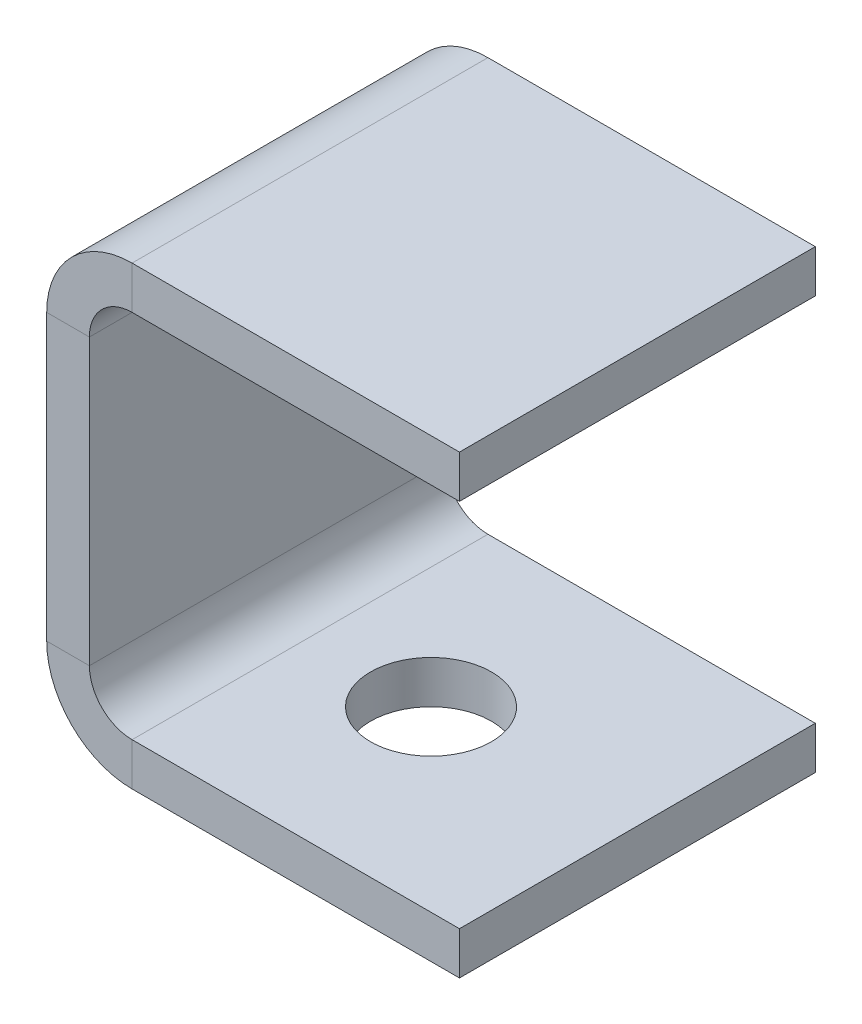
ISO-10303-21;
HEADER;
FILE_DESCRIPTION(('STEP AP214'),'2;1');
FILE_NAME('part.step','',(''),(''),'','','');
FILE_SCHEMA(('AUTOMOTIVE_DESIGN { 1 0 10303 214 1 1 1 1 }'));
ENDSEC;
DATA;
#1=APPLICATION_CONTEXT('core data for automotive mechanical design processes');
#2=APPLICATION_PROTOCOL_DEFINITION('international standard','automotive_design',2000,#1);
#3=PRODUCT_CONTEXT('',#1,'mechanical');
#4=PRODUCT('Part','Part','',(#3));
#5=PRODUCT_RELATED_PRODUCT_CATEGORY('part','',(#4));
#6=PRODUCT_DEFINITION_FORMATION('','',#4);
#7=PRODUCT_DEFINITION_CONTEXT('part definition',#1,'design');
#8=PRODUCT_DEFINITION('design','',#6,#7);
#9=PRODUCT_DEFINITION_SHAPE('','',#8);
#10=(LENGTH_UNIT() NAMED_UNIT(*) SI_UNIT(.MILLI.,.METRE.));
#11=(NAMED_UNIT(*) PLANE_ANGLE_UNIT() SI_UNIT($,.RADIAN.));
#12=(NAMED_UNIT(*) SI_UNIT($,.STERADIAN.) SOLID_ANGLE_UNIT());
#13=UNCERTAINTY_MEASURE_WITH_UNIT(LENGTH_MEASURE(1.E-05),#10,'distance_accuracy_value','');
#14=(GEOMETRIC_REPRESENTATION_CONTEXT(3) GLOBAL_UNCERTAINTY_ASSIGNED_CONTEXT((#13)) GLOBAL_UNIT_ASSIGNED_CONTEXT((#10,
#11,#12)) REPRESENTATION_CONTEXT('',''));
#15=CARTESIAN_POINT('',(0.,0.,0.));
#16=DIRECTION('',(0.,0.,1.));
#17=DIRECTION('',(1.,0.,0.));
#18=AXIS2_PLACEMENT_3D('',#15,#16,#17);
#19=CARTESIAN_POINT('',(6.00000000000007,-26.0000000000001,50.));
#20=DIRECTION('',(0.,0.,1.));
#21=DIRECTION('',(1.,0.,0.));
#22=AXIS2_PLACEMENT_3D('',#19,#20,#21);
#23=PLANE('',#22);
#24=DIRECTION('',(0.,-1.,0.));
#25=VECTOR('',#24,1.);
#26=CARTESIAN_POINT('',(6.00000000000007,-26.0000000000001,50.));
#27=LINE('',#26,#25);
#28=CARTESIAN_POINT('',(6.00000000000007,-26.0000000000001,50.));
#29=VERTEX_POINT('',#28);
#30=CARTESIAN_POINT('',(6.00000000000006,-32.0000000000002,50.));
#31=VERTEX_POINT('',#30);
#32=EDGE_CURVE('E13',#29,#31,#27,.T.);
#33=ORIENTED_EDGE('',*,*,#32,.F.);
#34=CARTESIAN_POINT('',(6.00000000000007,-20.,50.));
#35=DIRECTION('',(0.,0.,1.));
#36=DIRECTION('',(1.,0.,0.));
#37=AXIS2_PLACEMENT_3D('',#34,#35,#36);
#38=CIRCLE('',#37,6.);
#39=CARTESIAN_POINT('',(0.,-20.,50.));
#40=VERTEX_POINT('',#39);
#41=EDGE_CURVE('E160',#29,#40,#38,.F.);
#42=ORIENTED_EDGE('',*,*,#41,.T.);
#43=DIRECTION('',(1.,0.,0.));
#44=VECTOR('',#43,1.);
#45=CARTESIAN_POINT('',(-6.00000000000006,-20.,50.));
#46=LINE('',#45,#44);
#47=CARTESIAN_POINT('',(-6.00000000000006,-20.,50.));
#48=VERTEX_POINT('',#47);
#49=EDGE_CURVE('E58',#48,#40,#46,.T.);
#50=ORIENTED_EDGE('',*,*,#49,.F.);
#51=CARTESIAN_POINT('',(6.00000000000007,-20.,50.));
#52=DIRECTION('',(0.,0.,1.));
#53=DIRECTION('',(1.,0.,0.));
#54=AXIS2_PLACEMENT_3D('',#51,#52,#53);
#55=CIRCLE('',#54,12.);
#56=EDGE_CURVE('E255',#31,#48,#55,.F.);
#57=ORIENTED_EDGE('',*,*,#56,.F.);
#58=EDGE_LOOP('',(#33,#42,#50,#57));
#59=FACE_BOUND('',#58,.T.);
#60=ADVANCED_FACE('F50',(#59),#23,.T.);
#61=CARTESIAN_POINT('',(-6.00000000000006,-20.,50.));
#62=DIRECTION('',(0.,0.,1.));
#63=DIRECTION('',(1.,0.,0.));
#64=AXIS2_PLACEMENT_3D('',#61,#62,#63);
#65=PLANE('',#64);
#66=DIRECTION('',(-1.,0.,0.));
#67=VECTOR('',#66,1.);
#68=CARTESIAN_POINT('',(0.,-26.0000000000001,50.));
#69=LINE('',#68,#67);
#70=CARTESIAN_POINT('',(52.0000000000003,-26.0000000000001,50.));
#71=VERTEX_POINT('',#70);
#72=EDGE_CURVE('E165',#71,#29,#69,.T.);
#73=ORIENTED_EDGE('',*,*,#72,.T.);
#74=ORIENTED_EDGE('',*,*,#32,.T.);
#75=DIRECTION('',(1.,0.,0.));
#76=VECTOR('',#75,1.);
#77=CARTESIAN_POINT('',(0.,-32.0000000000002,50.));
#78=LINE('',#77,#76);
#79=CARTESIAN_POINT('',(52.0000000000003,-32.0000000000002,50.));
#80=VERTEX_POINT('',#79);
#81=EDGE_CURVE('E268',#80,#31,#78,.F.);
#82=ORIENTED_EDGE('',*,*,#81,.F.);
#83=DIRECTION('',(0.,-1.,0.));
#84=VECTOR('',#83,1.);
#85=CARTESIAN_POINT('',(52.0000000000003,-26.0000000000001,50.));
#86=LINE('',#85,#84);
#87=EDGE_CURVE('E270',#71,#80,#86,.T.);
#88=ORIENTED_EDGE('',*,*,#87,.F.);
#89=EDGE_LOOP('',(#73,#74,#82,#88));
#90=FACE_BOUND('',#89,.T.);
#91=ADVANCED_FACE('F281',(#90),#65,.T.);
#92=CARTESIAN_POINT('',(0.,-20.,0.));
#93=DIRECTION('',(0.,0.,-1.));
#94=DIRECTION('',(-1.,0.,0.));
#95=AXIS2_PLACEMENT_3D('',#92,#93,#94);
#96=PLANE('',#95);
#97=DIRECTION('',(-1.,0.,0.));
#98=VECTOR('',#97,1.);
#99=CARTESIAN_POINT('',(0.,-20.,0.));
#100=LINE('',#99,#98);
#101=CARTESIAN_POINT('',(0.,-20.,0.));
#102=VERTEX_POINT('',#101);
#103=CARTESIAN_POINT('',(-6.00000000000006,-20.,0.));
#104=VERTEX_POINT('',#103);
#105=EDGE_CURVE('E158',#102,#104,#100,.T.);
#106=ORIENTED_EDGE('',*,*,#105,.F.);
#107=CARTESIAN_POINT('',(6.00000000000007,-20.,0.));
#108=DIRECTION('',(0.,0.,1.));
#109=DIRECTION('',(1.,0.,0.));
#110=AXIS2_PLACEMENT_3D('',#107,#108,#109);
#111=CIRCLE('',#110,6.);
#112=CARTESIAN_POINT('',(6.00000000000007,-26.0000000000001,0.));
#113=VERTEX_POINT('',#112);
#114=EDGE_CURVE('E172',#113,#102,#111,.F.);
#115=ORIENTED_EDGE('',*,*,#114,.F.);
#116=DIRECTION('',(0.,1.,0.));
#117=VECTOR('',#116,1.);
#118=CARTESIAN_POINT('',(6.00000000000006,-32.0000000000002,0.));
#119=LINE('',#118,#117);
#120=CARTESIAN_POINT('',(6.00000000000006,-32.0000000000002,0.));
#121=VERTEX_POINT('',#120);
#122=EDGE_CURVE('E246',#121,#113,#119,.T.);
#123=ORIENTED_EDGE('',*,*,#122,.F.);
#124=CARTESIAN_POINT('',(6.00000000000007,-20.,0.));
#125=DIRECTION('',(0.,0.,1.));
#126=DIRECTION('',(1.,0.,0.));
#127=AXIS2_PLACEMENT_3D('',#124,#125,#126);
#128=CIRCLE('',#127,12.);
#129=EDGE_CURVE('E200',#121,#104,#128,.F.);
#130=ORIENTED_EDGE('',*,*,#129,.T.);
#131=EDGE_LOOP('',(#106,#115,#123,#130));
#132=FACE_BOUND('',#131,.T.);
#133=ADVANCED_FACE('F260',(#132),#96,.T.);
#134=CARTESIAN_POINT('',(6.00000000000006,-32.0000000000002,0.));
#135=DIRECTION('',(0.,0.,-1.));
#136=DIRECTION('',(-1.,0.,0.));
#137=AXIS2_PLACEMENT_3D('',#134,#135,#136);
#138=PLANE('',#137);
#139=DIRECTION('',(0.,1.,0.));
#140=VECTOR('',#139,1.);
#141=CARTESIAN_POINT('',(0.,26.0000000000002,0.));
#142=LINE('',#141,#140);
#143=CARTESIAN_POINT('',(0.,20.0000000000001,0.));
#144=VERTEX_POINT('',#143);
#145=EDGE_CURVE('E213',#102,#144,#142,.T.);
#146=ORIENTED_EDGE('',*,*,#145,.F.);
#147=ORIENTED_EDGE('',*,*,#105,.T.);
#148=DIRECTION('',(0.,1.,0.));
#149=VECTOR('',#148,1.);
#150=CARTESIAN_POINT('',(-6.00000000000012,26.0000000000002,0.));
#151=LINE('',#150,#149);
#152=CARTESIAN_POINT('',(-6.00000000000012,20.0000000000001,0.));
#153=VERTEX_POINT('',#152);
#154=EDGE_CURVE('E198',#104,#153,#151,.T.);
#155=ORIENTED_EDGE('',*,*,#154,.T.);
#156=DIRECTION('',(1.,0.,0.));
#157=VECTOR('',#156,1.);
#158=CARTESIAN_POINT('',(-6.00000000000012,20.0000000000001,0.));
#159=LINE('',#158,#157);
#160=EDGE_CURVE('E107',#153,#144,#159,.T.);
#161=ORIENTED_EDGE('',*,*,#160,.T.);
#162=EDGE_LOOP('',(#146,#147,#155,#161));
#163=FACE_BOUND('',#162,.T.);
#164=ADVANCED_FACE('F248',(#163),#138,.T.);
#165=CARTESIAN_POINT('',(0.,20.0000000000001,50.));
#166=DIRECTION('',(0.,0.,1.));
#167=DIRECTION('',(1.,0.,0.));
#168=AXIS2_PLACEMENT_3D('',#165,#166,#167);
#169=PLANE('',#168);
#170=DIRECTION('',(-1.,0.,0.));
#171=VECTOR('',#170,1.);
#172=CARTESIAN_POINT('',(0.,20.0000000000001,50.));
#173=LINE('',#172,#171);
#174=CARTESIAN_POINT('',(0.,20.0000000000001,50.));
#175=VERTEX_POINT('',#174);
#176=CARTESIAN_POINT('',(-6.00000000000012,20.0000000000001,50.));
#177=VERTEX_POINT('',#176);
#178=EDGE_CURVE('E244',#175,#177,#173,.T.);
#179=ORIENTED_EDGE('',*,*,#178,.F.);
#180=CARTESIAN_POINT('',(6.00000000000004,20.0000000000001,50.));
#181=DIRECTION('',(0.,0.,1.));
#182=DIRECTION('',(1.,0.,0.));
#183=AXIS2_PLACEMENT_3D('',#180,#181,#182);
#184=CIRCLE('',#183,6.);
#185=CARTESIAN_POINT('',(6.00000000000004,26.0000000000002,50.));
#186=VERTEX_POINT('',#185);
#187=EDGE_CURVE('E180',#175,#186,#184,.F.);
#188=ORIENTED_EDGE('',*,*,#187,.T.);
#189=DIRECTION('',(0.,-1.,0.));
#190=VECTOR('',#189,1.);
#191=CARTESIAN_POINT('',(6.00000000000004,32.0000000000001,50.));
#192=LINE('',#191,#190);
#193=CARTESIAN_POINT('',(6.00000000000004,32.0000000000001,50.));
#194=VERTEX_POINT('',#193);
#195=EDGE_CURVE('E66',#194,#186,#192,.T.);
#196=ORIENTED_EDGE('',*,*,#195,.F.);
#197=CARTESIAN_POINT('',(6.00000000000004,20.0000000000001,50.));
#198=DIRECTION('',(0.,0.,1.));
#199=DIRECTION('',(1.,0.,0.));
#200=AXIS2_PLACEMENT_3D('',#197,#198,#199);
#201=CIRCLE('',#200,12.);
#202=EDGE_CURVE('E272',#177,#194,#201,.F.);
#203=ORIENTED_EDGE('',*,*,#202,.F.);
#204=EDGE_LOOP('',(#179,#188,#196,#203));
#205=FACE_BOUND('',#204,.T.);
#206=ADVANCED_FACE('F309',(#205),#169,.T.);
#207=CARTESIAN_POINT('',(6.00000000000004,32.0000000000001,50.));
#208=DIRECTION('',(0.,0.,1.));
#209=DIRECTION('',(1.,0.,0.));
#210=AXIS2_PLACEMENT_3D('',#207,#208,#209);
#211=PLANE('',#210);
#212=DIRECTION('',(0.,1.,0.));
#213=VECTOR('',#212,1.);
#214=CARTESIAN_POINT('',(0.,26.0000000000002,50.));
#215=LINE('',#214,#213);
#216=EDGE_CURVE('E150',#40,#175,#215,.T.);
#217=ORIENTED_EDGE('',*,*,#216,.T.);
#218=ORIENTED_EDGE('',*,*,#178,.T.);
#219=DIRECTION('',(0.,1.,0.));
#220=VECTOR('',#219,1.);
#221=CARTESIAN_POINT('',(-6.00000000000012,26.0000000000002,50.));
#222=LINE('',#221,#220);
#223=EDGE_CURVE('E153',#48,#177,#222,.T.);
#224=ORIENTED_EDGE('',*,*,#223,.F.);
#225=ORIENTED_EDGE('',*,*,#49,.T.);
#226=EDGE_LOOP('',(#217,#218,#224,#225));
#227=FACE_BOUND('',#226,.T.);
#228=ADVANCED_FACE('F148',(#227),#211,.T.);
#229=CARTESIAN_POINT('',(6.00000000000004,26.0000000000002,0.));
#230=DIRECTION('',(0.,0.,-1.));
#231=DIRECTION('',(-1.,0.,0.));
#232=AXIS2_PLACEMENT_3D('',#229,#230,#231);
#233=PLANE('',#232);
#234=DIRECTION('',(0.,1.,0.));
#235=VECTOR('',#234,1.);
#236=CARTESIAN_POINT('',(6.00000000000004,26.0000000000002,0.));
#237=LINE('',#236,#235);
#238=CARTESIAN_POINT('',(6.00000000000004,26.0000000000002,0.));
#239=VERTEX_POINT('',#238);
#240=CARTESIAN_POINT('',(6.00000000000004,32.0000000000001,0.));
#241=VERTEX_POINT('',#240);
#242=EDGE_CURVE('E114',#239,#241,#237,.T.);
#243=ORIENTED_EDGE('',*,*,#242,.F.);
#244=CARTESIAN_POINT('',(6.00000000000004,20.0000000000001,0.));
#245=DIRECTION('',(0.,0.,1.));
#246=DIRECTION('',(1.,0.,0.));
#247=AXIS2_PLACEMENT_3D('',#244,#245,#246);
#248=CIRCLE('',#247,6.);
#249=EDGE_CURVE('E215',#144,#239,#248,.F.);
#250=ORIENTED_EDGE('',*,*,#249,.F.);
#251=ORIENTED_EDGE('',*,*,#160,.F.);
#252=CARTESIAN_POINT('',(6.00000000000004,20.0000000000001,0.));
#253=DIRECTION('',(0.,0.,1.));
#254=DIRECTION('',(1.,0.,0.));
#255=AXIS2_PLACEMENT_3D('',#252,#253,#254);
#256=CIRCLE('',#255,12.);
#257=EDGE_CURVE('E196',#153,#241,#256,.F.);
#258=ORIENTED_EDGE('',*,*,#257,.T.);
#259=EDGE_LOOP('',(#243,#250,#251,#258));
#260=FACE_BOUND('',#259,.T.);
#261=ADVANCED_FACE('F315',(#260),#233,.T.);
#262=CARTESIAN_POINT('',(-6.00000000000012,20.0000000000001,0.));
#263=DIRECTION('',(0.,0.,-1.));
#264=DIRECTION('',(-1.,0.,0.));
#265=AXIS2_PLACEMENT_3D('',#262,#263,#264);
#266=PLANE('',#265);
#267=DIRECTION('',(1.,0.,0.));
#268=VECTOR('',#267,1.);
#269=CARTESIAN_POINT('',(0.,26.0000000000002,0.));
#270=LINE('',#269,#268);
#271=CARTESIAN_POINT('',(52.0000000000003,26.0000000000001,0.));
#272=VERTEX_POINT('',#271);
#273=EDGE_CURVE('E186',#239,#272,#270,.T.);
#274=ORIENTED_EDGE('',*,*,#273,.F.);
#275=ORIENTED_EDGE('',*,*,#242,.T.);
#276=DIRECTION('',(1.,0.,0.));
#277=VECTOR('',#276,1.);
#278=CARTESIAN_POINT('',(0.,32.0000000000001,0.));
#279=LINE('',#278,#277);
#280=CARTESIAN_POINT('',(52.0000000000003,32.0000000000001,0.));
#281=VERTEX_POINT('',#280);
#282=EDGE_CURVE('E193',#241,#281,#279,.T.);
#283=ORIENTED_EDGE('',*,*,#282,.T.);
#284=DIRECTION('',(0.,-1.,0.));
#285=VECTOR('',#284,1.);
#286=CARTESIAN_POINT('',(52.0000000000003,32.0000000000001,0.));
#287=LINE('',#286,#285);
#288=EDGE_CURVE('E189',#281,#272,#287,.T.);
#289=ORIENTED_EDGE('',*,*,#288,.T.);
#290=EDGE_LOOP('',(#274,#275,#283,#289));
#291=FACE_BOUND('',#290,.T.);
#292=ADVANCED_FACE('F318',(#291),#266,.T.);
#293=CARTESIAN_POINT('',(0.,26.0000000000002,50.));
#294=DIRECTION('',(0.,1.,0.));
#295=DIRECTION('',(0.,0.,1.));
#296=AXIS2_PLACEMENT_3D('',#293,#294,#295);
#297=PLANE('',#296);
#298=ORIENTED_EDGE('',*,*,#273,.T.);
#299=DIRECTION('',(0.,0.,-1.));
#300=VECTOR('',#299,1.);
#301=CARTESIAN_POINT('',(52.0000000000003,26.0000000000001,50.));
#302=LINE('',#301,#300);
#303=CARTESIAN_POINT('',(52.0000000000003,26.0000000000001,50.));
#304=VERTEX_POINT('',#303);
#305=EDGE_CURVE('E239',#304,#272,#302,.T.);
#306=ORIENTED_EDGE('',*,*,#305,.F.);
#307=DIRECTION('',(1.,0.,0.));
#308=VECTOR('',#307,1.);
#309=CARTESIAN_POINT('',(0.,26.0000000000002,50.));
#310=LINE('',#309,#308);
#311=EDGE_CURVE('E120',#186,#304,#310,.T.);
#312=ORIENTED_EDGE('',*,*,#311,.F.);
#313=DIRECTION('',(0.,0.,-1.));
#314=VECTOR('',#313,1.);
#315=CARTESIAN_POINT('',(6.00000000000004,26.0000000000002,50.));
#316=LINE('',#315,#314);
#317=EDGE_CURVE('E182',#186,#239,#316,.T.);
#318=ORIENTED_EDGE('',*,*,#317,.T.);
#319=EDGE_LOOP('',(#298,#306,#312,#318));
#320=FACE_BOUND('',#319,.T.);
#321=ADVANCED_FACE('F321',(#320),#297,.F.);
#322=CARTESIAN_POINT('',(52.0000000000003,32.0000000000001,50.));
#323=DIRECTION('',(1.,0.,0.));
#324=DIRECTION('',(0.,0.,-1.));
#325=AXIS2_PLACEMENT_3D('',#322,#323,#324);
#326=PLANE('',#325);
#327=ORIENTED_EDGE('',*,*,#288,.F.);
#328=DIRECTION('',(0.,0.,-1.));
#329=VECTOR('',#328,1.);
#330=CARTESIAN_POINT('',(52.0000000000003,32.0000000000001,50.));
#331=LINE('',#330,#329);
#332=CARTESIAN_POINT('',(52.0000000000003,32.0000000000001,50.));
#333=VERTEX_POINT('',#332);
#334=EDGE_CURVE('E237',#333,#281,#331,.T.);
#335=ORIENTED_EDGE('',*,*,#334,.F.);
#336=DIRECTION('',(0.,-1.,0.));
#337=VECTOR('',#336,1.);
#338=CARTESIAN_POINT('',(52.0000000000003,32.0000000000001,50.));
#339=LINE('',#338,#337);
#340=EDGE_CURVE('E546',#333,#304,#339,.T.);
#341=ORIENTED_EDGE('',*,*,#340,.T.);
#342=ORIENTED_EDGE('',*,*,#305,.T.);
#343=EDGE_LOOP('',(#327,#335,#341,#342));
#344=FACE_BOUND('',#343,.T.);
#345=ADVANCED_FACE('F325',(#344),#326,.T.);
#346=CARTESIAN_POINT('',(0.,32.0000000000001,50.));
#347=DIRECTION('',(0.,1.,0.));
#348=DIRECTION('',(0.,0.,1.));
#349=AXIS2_PLACEMENT_3D('',#346,#347,#348);
#350=PLANE('',#349);
#351=ORIENTED_EDGE('',*,*,#282,.F.);
#352=DIRECTION('',(0.,0.,-1.));
#353=VECTOR('',#352,1.);
#354=CARTESIAN_POINT('',(6.00000000000004,32.0000000000001,50.));
#355=LINE('',#354,#353);
#356=EDGE_CURVE('E234',#194,#241,#355,.T.);
#357=ORIENTED_EDGE('',*,*,#356,.F.);
#358=DIRECTION('',(1.,0.,0.));
#359=VECTOR('',#358,1.);
#360=CARTESIAN_POINT('',(0.,32.0000000000001,50.));
#361=LINE('',#360,#359);
#362=EDGE_CURVE('E549',#194,#333,#361,.T.);
#363=ORIENTED_EDGE('',*,*,#362,.T.);
#364=ORIENTED_EDGE('',*,*,#334,.T.);
#365=EDGE_LOOP('',(#351,#357,#363,#364));
#366=FACE_BOUND('',#365,.T.);
#367=ADVANCED_FACE('F329',(#366),#350,.T.);
#368=CARTESIAN_POINT('',(6.00000000000004,20.0000000000001,50.));
#369=DIRECTION('',(0.,0.,-1.));
#370=DIRECTION('',(-1.,0.,0.));
#371=AXIS2_PLACEMENT_3D('',#368,#369,#370);
#372=CYLINDRICAL_SURFACE('',#371,12.);
#373=ORIENTED_EDGE('',*,*,#257,.F.);
#374=DIRECTION('',(0.,0.,-1.));
#375=VECTOR('',#374,1.);
#376=CARTESIAN_POINT('',(-6.00000000000012,20.0000000000001,50.));
#377=LINE('',#376,#375);
#378=EDGE_CURVE('E231',#177,#153,#377,.T.);
#379=ORIENTED_EDGE('',*,*,#378,.F.);
#380=ORIENTED_EDGE('',*,*,#202,.T.);
#381=ORIENTED_EDGE('',*,*,#356,.T.);
#382=EDGE_LOOP('',(#373,#379,#380,#381));
#383=FACE_BOUND('',#382,.T.);
#384=ADVANCED_FACE('F333',(#383),#372,.T.);
#385=CARTESIAN_POINT('',(-6.00000000000012,26.0000000000002,50.));
#386=DIRECTION('',(-1.,0.,0.));
#387=DIRECTION('',(0.,0.,1.));
#388=AXIS2_PLACEMENT_3D('',#385,#386,#387);
#389=PLANE('',#388);
#390=ORIENTED_EDGE('',*,*,#154,.F.);
#391=DIRECTION('',(0.,0.,-1.));
#392=VECTOR('',#391,1.);
#393=CARTESIAN_POINT('',(-6.00000000000006,-20.,50.));
#394=LINE('',#393,#392);
#395=EDGE_CURVE('E228',#48,#104,#394,.T.);
#396=ORIENTED_EDGE('',*,*,#395,.F.);
#397=ORIENTED_EDGE('',*,*,#223,.T.);
#398=ORIENTED_EDGE('',*,*,#378,.T.);
#399=EDGE_LOOP('',(#390,#396,#397,#398));
#400=FACE_BOUND('',#399,.T.);
#401=ADVANCED_FACE('F257',(#400),#389,.T.);
#402=CARTESIAN_POINT('',(6.00000000000007,-20.,50.));
#403=DIRECTION('',(0.,0.,-1.));
#404=DIRECTION('',(-1.,0.,0.));
#405=AXIS2_PLACEMENT_3D('',#402,#403,#404);
#406=CYLINDRICAL_SURFACE('',#405,12.);
#407=ORIENTED_EDGE('',*,*,#129,.F.);
#408=DIRECTION('',(0.,0.,-1.));
#409=VECTOR('',#408,1.);
#410=CARTESIAN_POINT('',(6.00000000000006,-32.0000000000002,50.));
#411=LINE('',#410,#409);
#412=EDGE_CURVE('E225',#31,#121,#411,.T.);
#413=ORIENTED_EDGE('',*,*,#412,.F.);
#414=ORIENTED_EDGE('',*,*,#56,.T.);
#415=ORIENTED_EDGE('',*,*,#395,.T.);
#416=EDGE_LOOP('',(#407,#413,#414,#415));
#417=FACE_BOUND('',#416,.T.);
#418=ADVANCED_FACE('F253',(#417),#406,.T.);
#419=CARTESIAN_POINT('',(0.,-32.0000000000002,50.));
#420=DIRECTION('',(0.,-1.,0.));
#421=DIRECTION('',(0.,0.,-1.));
#422=AXIS2_PLACEMENT_3D('',#419,#420,#421);
#423=PLANE('',#422);
#424=CARTESIAN_POINT('',(23.0000000000001,-32.0000000000001,25.));
#425=DIRECTION('',(0.,-1.,0.));
#426=DIRECTION('',(0.,0.,-1.));
#427=AXIS2_PLACEMENT_3D('',#424,#425,#426);
#428=CIRCLE('',#427,8.5);
#429=CARTESIAN_POINT('',(23.0000000000001,-32.0000000000001,16.5));
#430=VERTEX_POINT('',#429);
#431=EDGE_CURVE('E539',#430,#430,#428,.T.);
#432=ORIENTED_EDGE('',*,*,#431,.F.);
#433=EDGE_LOOP('',(#432));
#434=FACE_BOUND('',#433,.T.);
#435=DIRECTION('',(1.,0.,0.));
#436=VECTOR('',#435,1.);
#437=CARTESIAN_POINT('',(0.,-32.0000000000002,0.));
#438=LINE('',#437,#436);
#439=CARTESIAN_POINT('',(52.0000000000003,-32.0000000000002,0.));
#440=VERTEX_POINT('',#439);
#441=EDGE_CURVE('E203',#440,#121,#438,.F.);
#442=ORIENTED_EDGE('',*,*,#441,.F.);
#443=DIRECTION('',(0.,0.,-1.));
#444=VECTOR('',#443,1.);
#445=CARTESIAN_POINT('',(52.0000000000003,-32.0000000000002,50.));
#446=LINE('',#445,#444);
#447=EDGE_CURVE('E223',#80,#440,#446,.T.);
#448=ORIENTED_EDGE('',*,*,#447,.F.);
#449=ORIENTED_EDGE('',*,*,#81,.T.);
#450=ORIENTED_EDGE('',*,*,#412,.T.);
#451=EDGE_LOOP('',(#442,#448,#449,#450));
#452=FACE_BOUND('',#451,.T.);
#453=ADVANCED_FACE('F266',(#434,#452),#423,.T.);
#454=CARTESIAN_POINT('',(52.0000000000003,-26.0000000000001,50.));
#455=DIRECTION('',(1.,0.,0.));
#456=DIRECTION('',(0.,0.,-1.));
#457=AXIS2_PLACEMENT_3D('',#454,#455,#456);
#458=PLANE('',#457);
#459=DIRECTION('',(0.,-1.,0.));
#460=VECTOR('',#459,1.);
#461=CARTESIAN_POINT('',(52.0000000000003,-26.0000000000001,0.));
#462=LINE('',#461,#460);
#463=CARTESIAN_POINT('',(52.0000000000003,-26.0000000000001,0.));
#464=VERTEX_POINT('',#463);
#465=EDGE_CURVE('E206',#464,#440,#462,.T.);
#466=ORIENTED_EDGE('',*,*,#465,.F.);
#467=DIRECTION('',(0.,0.,-1.));
#468=VECTOR('',#467,1.);
#469=CARTESIAN_POINT('',(52.0000000000003,-26.0000000000001,50.));
#470=LINE('',#469,#468);
#471=EDGE_CURVE('E221',#71,#464,#470,.T.);
#472=ORIENTED_EDGE('',*,*,#471,.F.);
#473=ORIENTED_EDGE('',*,*,#87,.T.);
#474=ORIENTED_EDGE('',*,*,#447,.T.);
#475=EDGE_LOOP('',(#466,#472,#473,#474));
#476=FACE_BOUND('',#475,.T.);
#477=ADVANCED_FACE('F287',(#476),#458,.T.);
#478=CARTESIAN_POINT('',(0.,-26.0000000000001,50.));
#479=DIRECTION('',(0.,-1.,0.));
#480=DIRECTION('',(0.,0.,-1.));
#481=AXIS2_PLACEMENT_3D('',#478,#479,#480);
#482=PLANE('',#481);
#483=CARTESIAN_POINT('',(23.0000000000001,-26.0000000000001,25.));
#484=DIRECTION('',(0.,-1.,0.));
#485=DIRECTION('',(0.,0.,-1.));
#486=AXIS2_PLACEMENT_3D('',#483,#484,#485);
#487=CIRCLE('',#486,8.5);
#488=CARTESIAN_POINT('',(23.0000000000001,-26.0000000000001,16.5));
#489=VERTEX_POINT('',#488);
#490=EDGE_CURVE('E190',#489,#489,#487,.F.);
#491=ORIENTED_EDGE('',*,*,#490,.F.);
#492=EDGE_LOOP('',(#491));
#493=FACE_BOUND('',#492,.T.);
#494=DIRECTION('',(-1.,0.,0.));
#495=VECTOR('',#494,1.);
#496=CARTESIAN_POINT('',(0.,-26.0000000000001,0.));
#497=LINE('',#496,#495);
#498=EDGE_CURVE('E209',#464,#113,#497,.T.);
#499=ORIENTED_EDGE('',*,*,#498,.T.);
#500=DIRECTION('',(0.,0.,-1.));
#501=VECTOR('',#500,1.);
#502=CARTESIAN_POINT('',(6.00000000000007,-26.0000000000001,50.));
#503=LINE('',#502,#501);
#504=EDGE_CURVE('E174',#29,#113,#503,.T.);
#505=ORIENTED_EDGE('',*,*,#504,.F.);
#506=ORIENTED_EDGE('',*,*,#72,.F.);
#507=ORIENTED_EDGE('',*,*,#471,.T.);
#508=EDGE_LOOP('',(#499,#505,#506,#507));
#509=FACE_BOUND('',#508,.T.);
#510=ADVANCED_FACE('F283',(#493,#509),#482,.F.);
#511=CARTESIAN_POINT('',(6.00000000000007,-20.,50.));
#512=DIRECTION('',(0.,0.,-1.));
#513=DIRECTION('',(-1.,0.,0.));
#514=AXIS2_PLACEMENT_3D('',#511,#512,#513);
#515=CYLINDRICAL_SURFACE('',#514,6.);
#516=ORIENTED_EDGE('',*,*,#114,.T.);
#517=DIRECTION('',(0.,0.,-1.));
#518=VECTOR('',#517,1.);
#519=CARTESIAN_POINT('',(0.,-20.,50.));
#520=LINE('',#519,#518);
#521=EDGE_CURVE('E169',#40,#102,#520,.T.);
#522=ORIENTED_EDGE('',*,*,#521,.F.);
#523=ORIENTED_EDGE('',*,*,#41,.F.);
#524=ORIENTED_EDGE('',*,*,#504,.T.);
#525=EDGE_LOOP('',(#516,#522,#523,#524));
#526=FACE_BOUND('',#525,.T.);
#527=ADVANCED_FACE('F170',(#526),#515,.F.);
#528=CARTESIAN_POINT('',(0.,26.0000000000002,50.));
#529=DIRECTION('',(-1.,0.,0.));
#530=DIRECTION('',(0.,0.,1.));
#531=AXIS2_PLACEMENT_3D('',#528,#529,#530);
#532=PLANE('',#531);
#533=ORIENTED_EDGE('',*,*,#145,.T.);
#534=DIRECTION('',(0.,0.,-1.));
#535=VECTOR('',#534,1.);
#536=CARTESIAN_POINT('',(0.,20.0000000000001,50.));
#537=LINE('',#536,#535);
#538=EDGE_CURVE('E175',#175,#144,#537,.T.);
#539=ORIENTED_EDGE('',*,*,#538,.F.);
#540=ORIENTED_EDGE('',*,*,#216,.F.);
#541=ORIENTED_EDGE('',*,*,#521,.T.);
#542=EDGE_LOOP('',(#533,#539,#540,#541));
#543=FACE_BOUND('',#542,.T.);
#544=ADVANCED_FACE('F177',(#543),#532,.F.);
#545=CARTESIAN_POINT('',(6.00000000000004,20.0000000000001,50.));
#546=DIRECTION('',(0.,0.,-1.));
#547=DIRECTION('',(-1.,0.,0.));
#548=AXIS2_PLACEMENT_3D('',#545,#546,#547);
#549=CYLINDRICAL_SURFACE('',#548,6.);
#550=ORIENTED_EDGE('',*,*,#249,.T.);
#551=ORIENTED_EDGE('',*,*,#317,.F.);
#552=ORIENTED_EDGE('',*,*,#187,.F.);
#553=ORIENTED_EDGE('',*,*,#538,.T.);
#554=EDGE_LOOP('',(#550,#551,#552,#553));
#555=FACE_BOUND('',#554,.T.);
#556=ADVANCED_FACE('F380',(#555),#549,.F.);
#557=CARTESIAN_POINT('',(6.00000000000004,20.0000000000001,50.));
#558=DIRECTION('',(0.,0.,1.));
#559=DIRECTION('',(1.,0.,0.));
#560=AXIS2_PLACEMENT_3D('',#557,#558,#559);
#561=PLANE('',#560);
#562=ORIENTED_EDGE('',*,*,#311,.T.);
#563=ORIENTED_EDGE('',*,*,#340,.F.);
#564=ORIENTED_EDGE('',*,*,#362,.F.);
#565=ORIENTED_EDGE('',*,*,#195,.T.);
#566=EDGE_LOOP('',(#562,#563,#564,#565));
#567=FACE_BOUND('',#566,.T.);
#568=ADVANCED_FACE('F390',(#567),#561,.T.);
#569=CARTESIAN_POINT('',(6.00000000000004,20.0000000000001,0.));
#570=DIRECTION('',(0.,0.,1.));
#571=DIRECTION('',(1.,0.,0.));
#572=AXIS2_PLACEMENT_3D('',#569,#570,#571);
#573=PLANE('',#572);
#574=ORIENTED_EDGE('',*,*,#441,.T.);
#575=ORIENTED_EDGE('',*,*,#122,.T.);
#576=ORIENTED_EDGE('',*,*,#498,.F.);
#577=ORIENTED_EDGE('',*,*,#465,.T.);
#578=EDGE_LOOP('',(#574,#575,#576,#577));
#579=FACE_BOUND('',#578,.T.);
#580=ADVANCED_FACE('F285',(#579),#573,.F.);
#581=CARTESIAN_POINT('',(23.0000000000001,32.0010000000001,25.));
#582=DIRECTION('',(0.,-1.,0.));
#583=DIRECTION('',(0.,0.,-1.));
#584=AXIS2_PLACEMENT_3D('',#581,#582,#583);
#585=CYLINDRICAL_SURFACE('',#584,8.5);
#586=ORIENTED_EDGE('',*,*,#431,.T.);
#587=EDGE_LOOP('',(#586));
#588=FACE_BOUND('',#587,.T.);
#589=ORIENTED_EDGE('',*,*,#490,.T.);
#590=EDGE_LOOP('',(#589));
#591=FACE_BOUND('',#590,.T.);
#592=ADVANCED_FACE('F410',(#588,#591),#585,.F.);
#593=CLOSED_SHELL('',(#60,#91,#133,#164,#206,#228,#261,#292,#321,#345,#367,#384,#401,#418,#453,
#477,#510,#527,#544,#556,#568,#580,#592));
#594=MANIFOLD_SOLID_BREP('B2',#593);
#595=ADVANCED_BREP_SHAPE_REPRESENTATION('',(#18,#594),#14);
#596=SHAPE_DEFINITION_REPRESENTATION(#9,#595);
ENDSEC;
END-ISO-10303-21;
